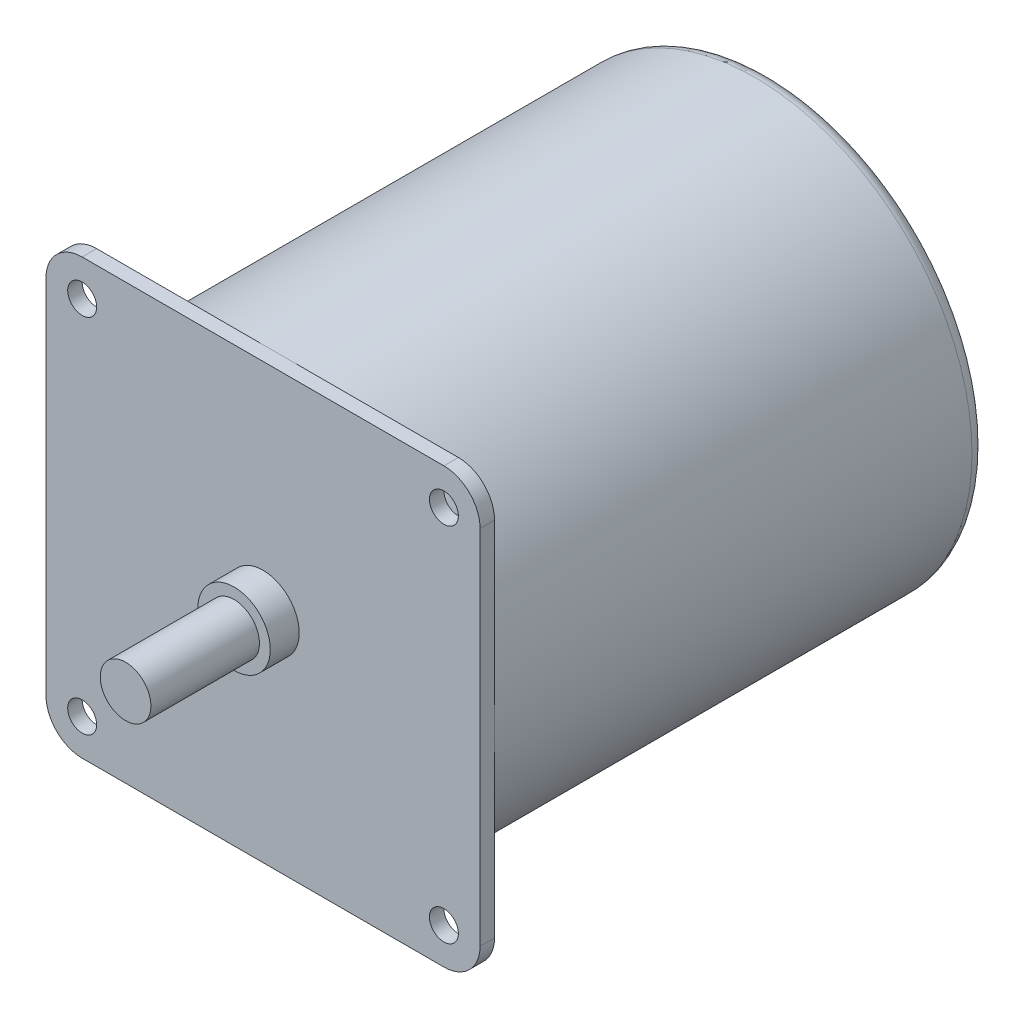
ISO-10303-21;
HEADER;
FILE_DESCRIPTION(('STEP AP214'),'2;1');
FILE_NAME('part.step','',(''),(''),'','','');
FILE_SCHEMA(('AUTOMOTIVE_DESIGN { 1 0 10303 214 1 1 1 1 }'));
ENDSEC;
DATA;
#1=APPLICATION_CONTEXT('core data for automotive mechanical design processes');
#2=APPLICATION_PROTOCOL_DEFINITION('international standard','automotive_design',2000,#1);
#3=PRODUCT_CONTEXT('',#1,'mechanical');
#4=PRODUCT('Part','Part','',(#3));
#5=PRODUCT_RELATED_PRODUCT_CATEGORY('part','',(#4));
#6=PRODUCT_DEFINITION_FORMATION('','',#4);
#7=PRODUCT_DEFINITION_CONTEXT('part definition',#1,'design');
#8=PRODUCT_DEFINITION('design','',#6,#7);
#9=PRODUCT_DEFINITION_SHAPE('','',#8);
#10=(LENGTH_UNIT() NAMED_UNIT(*) SI_UNIT(.MILLI.,.METRE.));
#11=(NAMED_UNIT(*) PLANE_ANGLE_UNIT() SI_UNIT($,.RADIAN.));
#12=(NAMED_UNIT(*) SI_UNIT($,.STERADIAN.) SOLID_ANGLE_UNIT());
#13=UNCERTAINTY_MEASURE_WITH_UNIT(LENGTH_MEASURE(1.E-05),#10,'distance_accuracy_value','');
#14=(GEOMETRIC_REPRESENTATION_CONTEXT(3) GLOBAL_UNCERTAINTY_ASSIGNED_CONTEXT((#13)) GLOBAL_UNIT_ASSIGNED_CONTEXT((#10,
#11,#12)) REPRESENTATION_CONTEXT('',''));
#15=CARTESIAN_POINT('',(0.,0.,0.));
#16=DIRECTION('',(0.,0.,1.));
#17=DIRECTION('',(1.,0.,0.));
#18=AXIS2_PLACEMENT_3D('',#15,#16,#17);
#19=CARTESIAN_POINT('',(0.,0.,89.));
#20=DIRECTION('',(0.,0.,-1.));
#21=DIRECTION('',(-1.,0.,0.));
#22=AXIS2_PLACEMENT_3D('',#19,#20,#21);
#23=CYLINDRICAL_SURFACE('',#22,3.5);
#24=CARTESIAN_POINT('',(0.,0.,89.));
#25=DIRECTION('',(0.,0.,1.));
#26=DIRECTION('',(1.,0.,0.));
#27=AXIS2_PLACEMENT_3D('',#24,#25,#26);
#28=CIRCLE('',#27,3.5);
#29=CARTESIAN_POINT('',(3.5,0.,89.));
#30=VERTEX_POINT('',#29);
#31=EDGE_CURVE('E11',#30,#30,#28,.T.);
#32=ORIENTED_EDGE('',*,*,#31,.F.);
#33=EDGE_LOOP('',(#32));
#34=FACE_BOUND('',#33,.T.);
#35=CARTESIAN_POINT('',(0.,0.,74.));
#36=DIRECTION('',(0.,0.,1.));
#37=DIRECTION('',(1.,0.,0.));
#38=AXIS2_PLACEMENT_3D('',#35,#36,#37);
#39=CIRCLE('',#38,3.5);
#40=CARTESIAN_POINT('',(3.5,0.,74.));
#41=VERTEX_POINT('',#40);
#42=EDGE_CURVE('E44',#41,#41,#39,.T.);
#43=ORIENTED_EDGE('',*,*,#42,.T.);
#44=EDGE_LOOP('',(#43));
#45=FACE_BOUND('',#44,.T.);
#46=ADVANCED_FACE('F41',(#34,#45),#23,.T.);
#47=CARTESIAN_POINT('',(0.,0.,89.));
#48=DIRECTION('',(0.,0.,1.));
#49=DIRECTION('',(1.,0.,0.));
#50=AXIS2_PLACEMENT_3D('',#47,#48,#49);
#51=PLANE('',#50);
#52=ORIENTED_EDGE('',*,*,#31,.T.);
#53=EDGE_LOOP('',(#52));
#54=FACE_BOUND('',#53,.T.);
#55=ADVANCED_FACE('F56',(#54),#51,.T.);
#56=CARTESIAN_POINT('',(0.,0.,74.));
#57=DIRECTION('',(0.,0.,1.));
#58=DIRECTION('',(1.,0.,0.));
#59=AXIS2_PLACEMENT_3D('',#56,#57,#58);
#60=PLANE('',#59);
#61=ORIENTED_EDGE('',*,*,#42,.F.);
#62=EDGE_LOOP('',(#61));
#63=FACE_BOUND('',#62,.T.);
#64=ADVANCED_FACE('F54',(#63),#60,.F.);
#65=CLOSED_SHELL('',(#46,#55,#64));
#66=MANIFOLD_SOLID_BREP('B2',#65);
#67=CARTESIAN_POINT('',(0.,0.,68.));
#68=DIRECTION('',(0.,0.,-1.));
#69=DIRECTION('',(-1.,0.,0.));
#70=AXIS2_PLACEMENT_3D('',#67,#68,#69);
#71=CYLINDRICAL_SURFACE('',#70,30.);
#72=CARTESIAN_POINT('',(0.,0.,2.));
#73=DIRECTION('',(0.,0.,1.));
#74=DIRECTION('',(1.,0.,0.));
#75=AXIS2_PLACEMENT_3D('',#72,#73,#74);
#76=CIRCLE('',#75,30.);
#77=CARTESIAN_POINT('',(30.,0.,2.));
#78=VERTEX_POINT('',#77);
#79=EDGE_CURVE('E192',#78,#78,#76,.T.);
#80=ORIENTED_EDGE('',*,*,#79,.T.);
#81=EDGE_LOOP('',(#80));
#82=FACE_BOUND('',#81,.T.);
#83=CARTESIAN_POINT('',(0.,0.,68.));
#84=DIRECTION('',(0.,0.,1.));
#85=DIRECTION('',(1.,0.,0.));
#86=AXIS2_PLACEMENT_3D('',#83,#84,#85);
#87=CIRCLE('',#86,30.);
#88=CARTESIAN_POINT('',(30.,0.,68.));
#89=VERTEX_POINT('',#88);
#90=CARTESIAN_POINT('',(0.,30.,68.));
#91=VERTEX_POINT('',#90);
#92=EDGE_CURVE('E186',#89,#91,#87,.T.);
#93=ORIENTED_EDGE('',*,*,#92,.F.);
#94=CARTESIAN_POINT('',(0.,-30.,68.));
#95=VERTEX_POINT('',#94);
#96=EDGE_CURVE('E97',#95,#89,#87,.T.);
#97=ORIENTED_EDGE('',*,*,#96,.F.);
#98=CARTESIAN_POINT('',(-30.,0.,68.));
#99=VERTEX_POINT('',#98);
#100=EDGE_CURVE('E101',#99,#95,#87,.T.);
#101=ORIENTED_EDGE('',*,*,#100,.F.);
#102=EDGE_CURVE('E193',#91,#99,#87,.T.);
#103=ORIENTED_EDGE('',*,*,#102,.F.);
#104=EDGE_LOOP('',(#93,#97,#101,#103));
#105=FACE_BOUND('',#104,.T.);
#106=ADVANCED_FACE('F82',(#82,#105),#71,.T.);
#107=CARTESIAN_POINT('',(0.,0.,0.));
#108=DIRECTION('',(0.,0.,1.));
#109=DIRECTION('',(1.,0.,0.));
#110=AXIS2_PLACEMENT_3D('',#107,#108,#109);
#111=PLANE('',#110);
#112=CARTESIAN_POINT('',(0.,0.,0.));
#113=DIRECTION('',(0.,0.,1.));
#114=DIRECTION('',(1.,0.,0.));
#115=AXIS2_PLACEMENT_3D('',#112,#113,#114);
#116=CIRCLE('',#115,28.);
#117=CARTESIAN_POINT('',(28.,0.,0.));
#118=VERTEX_POINT('',#117);
#119=EDGE_CURVE('E90',#118,#118,#116,.F.);
#120=ORIENTED_EDGE('',*,*,#119,.T.);
#121=EDGE_LOOP('',(#120));
#122=FACE_BOUND('',#121,.T.);
#123=ADVANCED_FACE('F198',(#122),#111,.F.);
#124=CARTESIAN_POINT('',(-25.,-25.,68.));
#125=DIRECTION('',(0.,0.,-1.));
#126=DIRECTION('',(-1.,0.,0.));
#127=AXIS2_PLACEMENT_3D('',#124,#125,#126);
#128=PLANE('',#127);
#129=CARTESIAN_POINT('',(25.,25.,68.));
#130=DIRECTION('',(0.,0.,1.));
#131=DIRECTION('',(-1.,0.,0.));
#132=AXIS2_PLACEMENT_3D('',#129,#130,#131);
#133=CIRCLE('',#132,1.99999999999999);
#134=CARTESIAN_POINT('',(23.,25.,68.));
#135=VERTEX_POINT('',#134);
#136=EDGE_CURVE('E458',#135,#135,#133,.T.);
#137=ORIENTED_EDGE('',*,*,#136,.T.);
#138=EDGE_LOOP('',(#137));
#139=FACE_BOUND('',#138,.T.);
#140=DIRECTION('',(0.,1.,0.));
#141=VECTOR('',#140,1.);
#142=CARTESIAN_POINT('',(30.,25.,68.));
#143=LINE('',#142,#141);
#144=CARTESIAN_POINT('',(30.,25.,68.));
#145=VERTEX_POINT('',#144);
#146=EDGE_CURVE('E220',#89,#145,#143,.T.);
#147=ORIENTED_EDGE('',*,*,#146,.F.);
#148=ORIENTED_EDGE('',*,*,#92,.T.);
#149=DIRECTION('',(-1.,0.,0.));
#150=VECTOR('',#149,1.);
#151=CARTESIAN_POINT('',(25.,30.,68.));
#152=LINE('',#151,#150);
#153=CARTESIAN_POINT('',(25.,30.,68.));
#154=VERTEX_POINT('',#153);
#155=EDGE_CURVE('E237',#154,#91,#152,.T.);
#156=ORIENTED_EDGE('',*,*,#155,.F.);
#157=CARTESIAN_POINT('',(25.,25.,68.));
#158=DIRECTION('',(0.,0.,1.));
#159=DIRECTION('',(1.,0.,0.));
#160=AXIS2_PLACEMENT_3D('',#157,#158,#159);
#161=CIRCLE('',#160,5.);
#162=EDGE_CURVE('E222',#145,#154,#161,.T.);
#163=ORIENTED_EDGE('',*,*,#162,.F.);
#164=EDGE_LOOP('',(#147,#148,#156,#163));
#165=FACE_BOUND('',#164,.T.);
#166=ADVANCED_FACE('F221',(#139,#165),#128,.T.);
#167=CARTESIAN_POINT('',(-25.,25.,68.));
#168=DIRECTION('',(0.,0.,1.));
#169=DIRECTION('',(1.,0.,0.));
#170=AXIS2_PLACEMENT_3D('',#167,#168,#169);
#171=CIRCLE('',#170,2.);
#172=CARTESIAN_POINT('',(-23.,25.,68.));
#173=VERTEX_POINT('',#172);
#174=EDGE_CURVE('E463',#173,#173,#171,.T.);
#175=ORIENTED_EDGE('',*,*,#174,.T.);
#176=EDGE_LOOP('',(#175));
#177=FACE_BOUND('',#176,.T.);
#178=CARTESIAN_POINT('',(-25.,30.,68.));
#179=VERTEX_POINT('',#178);
#180=EDGE_CURVE('E232',#91,#179,#152,.T.);
#181=ORIENTED_EDGE('',*,*,#180,.F.);
#182=ORIENTED_EDGE('',*,*,#102,.T.);
#183=DIRECTION('',(0.,-1.,0.));
#184=VECTOR('',#183,1.);
#185=CARTESIAN_POINT('',(-30.,25.,68.));
#186=LINE('',#185,#184);
#187=CARTESIAN_POINT('',(-30.,25.,68.));
#188=VERTEX_POINT('',#187);
#189=EDGE_CURVE('E179',#188,#99,#186,.T.);
#190=ORIENTED_EDGE('',*,*,#189,.F.);
#191=CARTESIAN_POINT('',(-25.,25.,68.));
#192=DIRECTION('',(0.,0.,1.));
#193=DIRECTION('',(1.,0.,0.));
#194=AXIS2_PLACEMENT_3D('',#191,#192,#193);
#195=CIRCLE('',#194,5.);
#196=EDGE_CURVE('E240',#179,#188,#195,.T.);
#197=ORIENTED_EDGE('',*,*,#196,.F.);
#198=EDGE_LOOP('',(#181,#182,#190,#197));
#199=FACE_BOUND('',#198,.T.);
#200=ADVANCED_FACE('F292',(#177,#199),#128,.T.);
#201=CARTESIAN_POINT('',(-25.,-25.,68.));
#202=DIRECTION('',(0.,0.,1.));
#203=DIRECTION('',(-1.,0.,0.));
#204=AXIS2_PLACEMENT_3D('',#201,#202,#203);
#205=CIRCLE('',#204,2.);
#206=CARTESIAN_POINT('',(-27.,-25.,68.));
#207=VERTEX_POINT('',#206);
#208=EDGE_CURVE('E317',#207,#207,#205,.T.);
#209=ORIENTED_EDGE('',*,*,#208,.T.);
#210=EDGE_LOOP('',(#209));
#211=FACE_BOUND('',#210,.T.);
#212=CARTESIAN_POINT('',(-30.,-25.,68.));
#213=VERTEX_POINT('',#212);
#214=EDGE_CURVE('E242',#99,#213,#186,.T.);
#215=ORIENTED_EDGE('',*,*,#214,.F.);
#216=ORIENTED_EDGE('',*,*,#100,.T.);
#217=DIRECTION('',(1.,0.,0.));
#218=VECTOR('',#217,1.);
#219=CARTESIAN_POINT('',(25.,-30.,68.));
#220=LINE('',#219,#218);
#221=CARTESIAN_POINT('',(-25.,-30.,68.));
#222=VERTEX_POINT('',#221);
#223=EDGE_CURVE('E273',#222,#95,#220,.T.);
#224=ORIENTED_EDGE('',*,*,#223,.F.);
#225=CARTESIAN_POINT('',(-25.,-25.,68.));
#226=DIRECTION('',(0.,0.,1.));
#227=DIRECTION('',(-1.,0.,0.));
#228=AXIS2_PLACEMENT_3D('',#225,#226,#227);
#229=CIRCLE('',#228,5.);
#230=EDGE_CURVE('E183',#213,#222,#229,.T.);
#231=ORIENTED_EDGE('',*,*,#230,.F.);
#232=EDGE_LOOP('',(#215,#216,#224,#231));
#233=FACE_BOUND('',#232,.T.);
#234=ADVANCED_FACE('F298',(#211,#233),#128,.T.);
#235=CARTESIAN_POINT('',(-25.,-25.,70.));
#236=DIRECTION('',(0.,0.,-1.));
#237=DIRECTION('',(-1.,0.,0.));
#238=AXIS2_PLACEMENT_3D('',#235,#236,#237);
#239=PLANE('',#238);
#240=CARTESIAN_POINT('',(0.,0.,70.));
#241=DIRECTION('',(0.,0.,-1.));
#242=DIRECTION('',(-1.,0.,0.));
#243=AXIS2_PLACEMENT_3D('',#240,#241,#242);
#244=CIRCLE('',#243,5.);
#245=CARTESIAN_POINT('',(-5.,0.,70.));
#246=VERTEX_POINT('',#245);
#247=EDGE_CURVE('E39',#246,#246,#244,.F.);
#248=ORIENTED_EDGE('',*,*,#247,.F.);
#249=EDGE_LOOP('',(#248));
#250=FACE_BOUND('',#249,.T.);
#251=CARTESIAN_POINT('',(-25.,-25.,70.));
#252=DIRECTION('',(0.,0.,1.));
#253=DIRECTION('',(-1.,0.,0.));
#254=AXIS2_PLACEMENT_3D('',#251,#252,#253);
#255=CIRCLE('',#254,5.);
#256=CARTESIAN_POINT('',(-30.,-25.,70.));
#257=VERTEX_POINT('',#256);
#258=CARTESIAN_POINT('',(-25.,-30.,70.));
#259=VERTEX_POINT('',#258);
#260=EDGE_CURVE('E169',#257,#259,#255,.T.);
#261=ORIENTED_EDGE('',*,*,#260,.T.);
#262=DIRECTION('',(1.,0.,0.));
#263=VECTOR('',#262,1.);
#264=CARTESIAN_POINT('',(25.,-30.,70.));
#265=LINE('',#264,#263);
#266=CARTESIAN_POINT('',(25.,-30.,70.));
#267=VERTEX_POINT('',#266);
#268=EDGE_CURVE('E157',#259,#267,#265,.T.);
#269=ORIENTED_EDGE('',*,*,#268,.T.);
#270=CARTESIAN_POINT('',(25.,-25.,70.));
#271=DIRECTION('',(0.,0.,1.));
#272=DIRECTION('',(1.,0.,0.));
#273=AXIS2_PLACEMENT_3D('',#270,#271,#272);
#274=CIRCLE('',#273,5.);
#275=CARTESIAN_POINT('',(30.,-25.,70.));
#276=VERTEX_POINT('',#275);
#277=EDGE_CURVE('E168',#267,#276,#274,.T.);
#278=ORIENTED_EDGE('',*,*,#277,.T.);
#279=DIRECTION('',(0.,1.,0.));
#280=VECTOR('',#279,1.);
#281=CARTESIAN_POINT('',(30.,25.,70.));
#282=LINE('',#281,#280);
#283=CARTESIAN_POINT('',(30.,25.,70.));
#284=VERTEX_POINT('',#283);
#285=EDGE_CURVE('E262',#276,#284,#282,.T.);
#286=ORIENTED_EDGE('',*,*,#285,.T.);
#287=CARTESIAN_POINT('',(25.,25.,70.));
#288=DIRECTION('',(0.,0.,1.));
#289=DIRECTION('',(1.,0.,0.));
#290=AXIS2_PLACEMENT_3D('',#287,#288,#289);
#291=CIRCLE('',#290,5.);
#292=CARTESIAN_POINT('',(25.,30.,70.));
#293=VERTEX_POINT('',#292);
#294=EDGE_CURVE('E261',#284,#293,#291,.T.);
#295=ORIENTED_EDGE('',*,*,#294,.T.);
#296=DIRECTION('',(-1.,0.,0.));
#297=VECTOR('',#296,1.);
#298=CARTESIAN_POINT('',(25.,30.,70.));
#299=LINE('',#298,#297);
#300=CARTESIAN_POINT('',(-25.,30.,70.));
#301=VERTEX_POINT('',#300);
#302=EDGE_CURVE('E264',#293,#301,#299,.T.);
#303=ORIENTED_EDGE('',*,*,#302,.T.);
#304=CARTESIAN_POINT('',(-25.,25.,70.));
#305=DIRECTION('',(0.,0.,1.));
#306=DIRECTION('',(1.,0.,0.));
#307=AXIS2_PLACEMENT_3D('',#304,#305,#306);
#308=CIRCLE('',#307,5.);
#309=CARTESIAN_POINT('',(-30.,25.,70.));
#310=VERTEX_POINT('',#309);
#311=EDGE_CURVE('E269',#301,#310,#308,.T.);
#312=ORIENTED_EDGE('',*,*,#311,.T.);
#313=DIRECTION('',(0.,-1.,0.));
#314=VECTOR('',#313,1.);
#315=CARTESIAN_POINT('',(-30.,25.,70.));
#316=LINE('',#315,#314);
#317=EDGE_CURVE('E175',#310,#257,#316,.T.);
#318=ORIENTED_EDGE('',*,*,#317,.T.);
#319=EDGE_LOOP('',(#261,#269,#278,#286,#295,#303,#312,#318));
#320=FACE_BOUND('',#319,.T.);
#321=CARTESIAN_POINT('',(-25.,25.,70.));
#322=DIRECTION('',(0.,0.,1.));
#323=DIRECTION('',(1.,0.,0.));
#324=AXIS2_PLACEMENT_3D('',#321,#322,#323);
#325=CIRCLE('',#324,2.);
#326=CARTESIAN_POINT('',(-23.,25.,70.));
#327=VERTEX_POINT('',#326);
#328=EDGE_CURVE('E272',#327,#327,#325,.T.);
#329=ORIENTED_EDGE('',*,*,#328,.F.);
#330=EDGE_LOOP('',(#329));
#331=FACE_BOUND('',#330,.T.);
#332=CARTESIAN_POINT('',(25.,25.,70.));
#333=DIRECTION('',(0.,0.,1.));
#334=DIRECTION('',(-1.,0.,0.));
#335=AXIS2_PLACEMENT_3D('',#332,#333,#334);
#336=CIRCLE('',#335,1.99999999999999);
#337=CARTESIAN_POINT('',(23.,25.,70.));
#338=VERTEX_POINT('',#337);
#339=EDGE_CURVE('E460',#338,#338,#336,.T.);
#340=ORIENTED_EDGE('',*,*,#339,.F.);
#341=EDGE_LOOP('',(#340));
#342=FACE_BOUND('',#341,.T.);
#343=CARTESIAN_POINT('',(25.,-25.,70.));
#344=DIRECTION('',(0.,0.,1.));
#345=DIRECTION('',(1.,0.,0.));
#346=AXIS2_PLACEMENT_3D('',#343,#344,#345);
#347=CIRCLE('',#346,2.);
#348=CARTESIAN_POINT('',(27.,-25.,70.));
#349=VERTEX_POINT('',#348);
#350=EDGE_CURVE('E455',#349,#349,#347,.T.);
#351=ORIENTED_EDGE('',*,*,#350,.F.);
#352=EDGE_LOOP('',(#351));
#353=FACE_BOUND('',#352,.T.);
#354=CARTESIAN_POINT('',(-25.,-25.,70.));
#355=DIRECTION('',(0.,0.,1.));
#356=DIRECTION('',(-1.,0.,0.));
#357=AXIS2_PLACEMENT_3D('',#354,#355,#356);
#358=CIRCLE('',#357,2.);
#359=CARTESIAN_POINT('',(-27.,-25.,70.));
#360=VERTEX_POINT('',#359);
#361=EDGE_CURVE('E449',#360,#360,#358,.T.);
#362=ORIENTED_EDGE('',*,*,#361,.F.);
#363=EDGE_LOOP('',(#362));
#364=FACE_BOUND('',#363,.T.);
#365=ADVANCED_FACE('F172',(#250,#320,#331,#342,#353,#364),#239,.F.);
#366=CARTESIAN_POINT('',(25.,-25.,68.));
#367=DIRECTION('',(0.,0.,1.));
#368=DIRECTION('',(1.,0.,0.));
#369=AXIS2_PLACEMENT_3D('',#366,#367,#368);
#370=CIRCLE('',#369,2.);
#371=CARTESIAN_POINT('',(27.,-25.,68.));
#372=VERTEX_POINT('',#371);
#373=EDGE_CURVE('E453',#372,#372,#370,.T.);
#374=ORIENTED_EDGE('',*,*,#373,.T.);
#375=EDGE_LOOP('',(#374));
#376=FACE_BOUND('',#375,.T.);
#377=CARTESIAN_POINT('',(25.,-30.,68.));
#378=VERTEX_POINT('',#377);
#379=EDGE_CURVE('E218',#95,#378,#220,.T.);
#380=ORIENTED_EDGE('',*,*,#379,.F.);
#381=ORIENTED_EDGE('',*,*,#96,.T.);
#382=CARTESIAN_POINT('',(30.,-25.,68.));
#383=VERTEX_POINT('',#382);
#384=EDGE_CURVE('E217',#383,#89,#143,.T.);
#385=ORIENTED_EDGE('',*,*,#384,.F.);
#386=CARTESIAN_POINT('',(25.,-25.,68.));
#387=DIRECTION('',(0.,0.,1.));
#388=DIRECTION('',(1.,0.,0.));
#389=AXIS2_PLACEMENT_3D('',#386,#387,#388);
#390=CIRCLE('',#389,5.);
#391=EDGE_CURVE('E226',#378,#383,#390,.T.);
#392=ORIENTED_EDGE('',*,*,#391,.F.);
#393=EDGE_LOOP('',(#380,#381,#385,#392));
#394=FACE_BOUND('',#393,.T.);
#395=ADVANCED_FACE('F214',(#376,#394),#128,.T.);
#396=CARTESIAN_POINT('',(-25.,-25.,70.));
#397=DIRECTION('',(0.,0.,-1.));
#398=DIRECTION('',(-1.,0.,0.));
#399=AXIS2_PLACEMENT_3D('',#396,#397,#398);
#400=CYLINDRICAL_SURFACE('',#399,5.);
#401=ORIENTED_EDGE('',*,*,#230,.T.);
#402=DIRECTION('',(0.,0.,-1.));
#403=VECTOR('',#402,1.);
#404=CARTESIAN_POINT('',(-25.,-30.,70.));
#405=LINE('',#404,#403);
#406=EDGE_CURVE('E162',#259,#222,#405,.T.);
#407=ORIENTED_EDGE('',*,*,#406,.F.);
#408=ORIENTED_EDGE('',*,*,#260,.F.);
#409=DIRECTION('',(0.,0.,-1.));
#410=VECTOR('',#409,1.);
#411=CARTESIAN_POINT('',(-30.,-25.,70.));
#412=LINE('',#411,#410);
#413=EDGE_CURVE('E245',#257,#213,#412,.T.);
#414=ORIENTED_EDGE('',*,*,#413,.T.);
#415=EDGE_LOOP('',(#401,#407,#408,#414));
#416=FACE_BOUND('',#415,.T.);
#417=ADVANCED_FACE('F181',(#416),#400,.T.);
#418=CARTESIAN_POINT('',(25.,-30.,70.));
#419=DIRECTION('',(0.,1.,0.));
#420=DIRECTION('',(-1.,0.,0.));
#421=AXIS2_PLACEMENT_3D('',#418,#419,#420);
#422=PLANE('',#421);
#423=ORIENTED_EDGE('',*,*,#223,.T.);
#424=ORIENTED_EDGE('',*,*,#379,.T.);
#425=DIRECTION('',(0.,0.,-1.));
#426=VECTOR('',#425,1.);
#427=CARTESIAN_POINT('',(25.,-30.,70.));
#428=LINE('',#427,#426);
#429=EDGE_CURVE('E165',#267,#378,#428,.T.);
#430=ORIENTED_EDGE('',*,*,#429,.F.);
#431=ORIENTED_EDGE('',*,*,#268,.F.);
#432=ORIENTED_EDGE('',*,*,#406,.T.);
#433=EDGE_LOOP('',(#423,#424,#430,#431,#432));
#434=FACE_BOUND('',#433,.T.);
#435=ADVANCED_FACE('F160',(#434),#422,.F.);
#436=CARTESIAN_POINT('',(25.,-25.,70.));
#437=DIRECTION('',(0.,0.,-1.));
#438=DIRECTION('',(-1.,0.,0.));
#439=AXIS2_PLACEMENT_3D('',#436,#437,#438);
#440=CYLINDRICAL_SURFACE('',#439,5.);
#441=ORIENTED_EDGE('',*,*,#391,.T.);
#442=DIRECTION('',(0.,0.,-1.));
#443=VECTOR('',#442,1.);
#444=CARTESIAN_POINT('',(30.,-25.,70.));
#445=LINE('',#444,#443);
#446=EDGE_CURVE('E187',#276,#383,#445,.T.);
#447=ORIENTED_EDGE('',*,*,#446,.F.);
#448=ORIENTED_EDGE('',*,*,#277,.F.);
#449=ORIENTED_EDGE('',*,*,#429,.T.);
#450=EDGE_LOOP('',(#441,#447,#448,#449));
#451=FACE_BOUND('',#450,.T.);
#452=ADVANCED_FACE('F275',(#451),#440,.T.);
#453=CARTESIAN_POINT('',(30.,25.,70.));
#454=DIRECTION('',(-1.,0.,0.));
#455=DIRECTION('',(0.,-1.,0.));
#456=AXIS2_PLACEMENT_3D('',#453,#454,#455);
#457=PLANE('',#456);
#458=ORIENTED_EDGE('',*,*,#384,.T.);
#459=ORIENTED_EDGE('',*,*,#146,.T.);
#460=DIRECTION('',(0.,0.,-1.));
#461=VECTOR('',#460,1.);
#462=CARTESIAN_POINT('',(30.,25.,70.));
#463=LINE('',#462,#461);
#464=EDGE_CURVE('E256',#284,#145,#463,.T.);
#465=ORIENTED_EDGE('',*,*,#464,.F.);
#466=ORIENTED_EDGE('',*,*,#285,.F.);
#467=ORIENTED_EDGE('',*,*,#446,.T.);
#468=EDGE_LOOP('',(#458,#459,#465,#466,#467));
#469=FACE_BOUND('',#468,.T.);
#470=ADVANCED_FACE('F229',(#469),#457,.F.);
#471=CARTESIAN_POINT('',(25.,25.,70.));
#472=DIRECTION('',(0.,0.,-1.));
#473=DIRECTION('',(-1.,0.,0.));
#474=AXIS2_PLACEMENT_3D('',#471,#472,#473);
#475=CYLINDRICAL_SURFACE('',#474,5.);
#476=ORIENTED_EDGE('',*,*,#162,.T.);
#477=DIRECTION('',(0.,0.,-1.));
#478=VECTOR('',#477,1.);
#479=CARTESIAN_POINT('',(25.,30.,70.));
#480=LINE('',#479,#478);
#481=EDGE_CURVE('E253',#293,#154,#480,.T.);
#482=ORIENTED_EDGE('',*,*,#481,.F.);
#483=ORIENTED_EDGE('',*,*,#294,.F.);
#484=ORIENTED_EDGE('',*,*,#464,.T.);
#485=EDGE_LOOP('',(#476,#482,#483,#484));
#486=FACE_BOUND('',#485,.T.);
#487=ADVANCED_FACE('F259',(#486),#475,.T.);
#488=CARTESIAN_POINT('',(25.,30.,70.));
#489=DIRECTION('',(0.,-1.,0.));
#490=DIRECTION('',(1.,0.,0.));
#491=AXIS2_PLACEMENT_3D('',#488,#489,#490);
#492=PLANE('',#491);
#493=ORIENTED_EDGE('',*,*,#155,.T.);
#494=ORIENTED_EDGE('',*,*,#180,.T.);
#495=DIRECTION('',(0.,0.,-1.));
#496=VECTOR('',#495,1.);
#497=CARTESIAN_POINT('',(-25.,30.,70.));
#498=LINE('',#497,#496);
#499=EDGE_CURVE('E250',#301,#179,#498,.T.);
#500=ORIENTED_EDGE('',*,*,#499,.F.);
#501=ORIENTED_EDGE('',*,*,#302,.F.);
#502=ORIENTED_EDGE('',*,*,#481,.T.);
#503=EDGE_LOOP('',(#493,#494,#500,#501,#502));
#504=FACE_BOUND('',#503,.T.);
#505=ADVANCED_FACE('F327',(#504),#492,.F.);
#506=CARTESIAN_POINT('',(-25.,25.,70.));
#507=DIRECTION('',(0.,0.,-1.));
#508=DIRECTION('',(-1.,0.,0.));
#509=AXIS2_PLACEMENT_3D('',#506,#507,#508);
#510=CYLINDRICAL_SURFACE('',#509,5.);
#511=ORIENTED_EDGE('',*,*,#196,.T.);
#512=DIRECTION('',(0.,0.,-1.));
#513=VECTOR('',#512,1.);
#514=CARTESIAN_POINT('',(-30.,25.,70.));
#515=LINE('',#514,#513);
#516=EDGE_CURVE('E247',#310,#188,#515,.T.);
#517=ORIENTED_EDGE('',*,*,#516,.F.);
#518=ORIENTED_EDGE('',*,*,#311,.F.);
#519=ORIENTED_EDGE('',*,*,#499,.T.);
#520=EDGE_LOOP('',(#511,#517,#518,#519));
#521=FACE_BOUND('',#520,.T.);
#522=ADVANCED_FACE('F331',(#521),#510,.T.);
#523=CARTESIAN_POINT('',(-30.,25.,70.));
#524=DIRECTION('',(1.,0.,0.));
#525=DIRECTION('',(0.,1.,0.));
#526=AXIS2_PLACEMENT_3D('',#523,#524,#525);
#527=PLANE('',#526);
#528=ORIENTED_EDGE('',*,*,#189,.T.);
#529=ORIENTED_EDGE('',*,*,#214,.T.);
#530=ORIENTED_EDGE('',*,*,#413,.F.);
#531=ORIENTED_EDGE('',*,*,#317,.F.);
#532=ORIENTED_EDGE('',*,*,#516,.T.);
#533=EDGE_LOOP('',(#528,#529,#530,#531,#532));
#534=FACE_BOUND('',#533,.T.);
#535=ADVANCED_FACE('F321',(#534),#527,.F.);
#536=CARTESIAN_POINT('',(-25.,25.,70.));
#537=DIRECTION('',(0.,0.,-1.));
#538=DIRECTION('',(-1.,0.,0.));
#539=AXIS2_PLACEMENT_3D('',#536,#537,#538);
#540=CYLINDRICAL_SURFACE('',#539,2.);
#541=ORIENTED_EDGE('',*,*,#328,.T.);
#542=EDGE_LOOP('',(#541));
#543=FACE_BOUND('',#542,.T.);
#544=ORIENTED_EDGE('',*,*,#174,.F.);
#545=EDGE_LOOP('',(#544));
#546=FACE_BOUND('',#545,.T.);
#547=ADVANCED_FACE('F338',(#543,#546),#540,.F.);
#548=CARTESIAN_POINT('',(25.,25.,70.));
#549=DIRECTION('',(0.,0.,-1.));
#550=DIRECTION('',(-1.,0.,0.));
#551=AXIS2_PLACEMENT_3D('',#548,#549,#550);
#552=CYLINDRICAL_SURFACE('',#551,1.99999999999999);
#553=ORIENTED_EDGE('',*,*,#339,.T.);
#554=EDGE_LOOP('',(#553));
#555=FACE_BOUND('',#554,.T.);
#556=ORIENTED_EDGE('',*,*,#136,.F.);
#557=EDGE_LOOP('',(#556));
#558=FACE_BOUND('',#557,.T.);
#559=ADVANCED_FACE('F368',(#555,#558),#552,.F.);
#560=CARTESIAN_POINT('',(25.,-25.,70.));
#561=DIRECTION('',(0.,0.,-1.));
#562=DIRECTION('',(-1.,0.,0.));
#563=AXIS2_PLACEMENT_3D('',#560,#561,#562);
#564=CYLINDRICAL_SURFACE('',#563,2.);
#565=ORIENTED_EDGE('',*,*,#350,.T.);
#566=EDGE_LOOP('',(#565));
#567=FACE_BOUND('',#566,.T.);
#568=ORIENTED_EDGE('',*,*,#373,.F.);
#569=EDGE_LOOP('',(#568));
#570=FACE_BOUND('',#569,.T.);
#571=ADVANCED_FACE('F378',(#567,#570),#564,.F.);
#572=CARTESIAN_POINT('',(-25.,-25.,70.));
#573=DIRECTION('',(0.,0.,-1.));
#574=DIRECTION('',(-1.,0.,0.));
#575=AXIS2_PLACEMENT_3D('',#572,#573,#574);
#576=CYLINDRICAL_SURFACE('',#575,2.);
#577=ORIENTED_EDGE('',*,*,#361,.T.);
#578=EDGE_LOOP('',(#577));
#579=FACE_BOUND('',#578,.T.);
#580=ORIENTED_EDGE('',*,*,#208,.F.);
#581=EDGE_LOOP('',(#580));
#582=FACE_BOUND('',#581,.T.);
#583=ADVANCED_FACE('F203',(#579,#582),#576,.F.);
#584=CARTESIAN_POINT('',(0.,0.,2.));
#585=DIRECTION('',(0.,0.,1.));
#586=DIRECTION('',(1.,0.,0.));
#587=AXIS2_PLACEMENT_3D('',#584,#585,#586);
#588=TOROIDAL_SURFACE('',#587,28.,2.);
#589=ORIENTED_EDGE('',*,*,#119,.F.);
#590=EDGE_LOOP('',(#589));
#591=FACE_BOUND('',#590,.T.);
#592=ORIENTED_EDGE('',*,*,#79,.F.);
#593=EDGE_LOOP('',(#592));
#594=FACE_BOUND('',#593,.T.);
#595=ADVANCED_FACE('F84',(#591,#594),#588,.T.);
#596=CARTESIAN_POINT('',(0.,0.,74.));
#597=DIRECTION('',(0.,0.,-1.));
#598=DIRECTION('',(-1.,0.,0.));
#599=AXIS2_PLACEMENT_3D('',#596,#597,#598);
#600=CYLINDRICAL_SURFACE('',#599,5.);
#601=CARTESIAN_POINT('',(0.,0.,74.));
#602=DIRECTION('',(0.,0.,1.));
#603=DIRECTION('',(1.,0.,0.));
#604=AXIS2_PLACEMENT_3D('',#601,#602,#603);
#605=CIRCLE('',#604,5.);
#606=CARTESIAN_POINT('',(5.,0.,74.));
#607=VERTEX_POINT('',#606);
#608=EDGE_CURVE('E447',#607,#607,#605,.T.);
#609=ORIENTED_EDGE('',*,*,#608,.F.);
#610=EDGE_LOOP('',(#609));
#611=FACE_BOUND('',#610,.T.);
#612=ORIENTED_EDGE('',*,*,#247,.T.);
#613=EDGE_LOOP('',(#612));
#614=FACE_BOUND('',#613,.T.);
#615=ADVANCED_FACE('F202',(#611,#614),#600,.T.);
#616=CARTESIAN_POINT('',(0.,0.,74.));
#617=DIRECTION('',(0.,0.,1.));
#618=DIRECTION('',(1.,0.,0.));
#619=AXIS2_PLACEMENT_3D('',#616,#617,#618);
#620=PLANE('',#619);
#621=ORIENTED_EDGE('',*,*,#608,.T.);
#622=EDGE_LOOP('',(#621));
#623=FACE_BOUND('',#622,.T.);
#624=ADVANCED_FACE('F431',(#623),#620,.T.);
#625=CLOSED_SHELL('',(#106,#123,#166,#200,#234,#365,#395,#417,#435,#452,#470,#487,#505,#522,
#535,#547,#559,#571,#583,#595,#615,#624));
#626=MANIFOLD_SOLID_BREP('B6',#625);
#627=ADVANCED_BREP_SHAPE_REPRESENTATION('',(#18,#66,#626),#14);
#628=SHAPE_DEFINITION_REPRESENTATION(#9,#627);
ENDSEC;
END-ISO-10303-21;
